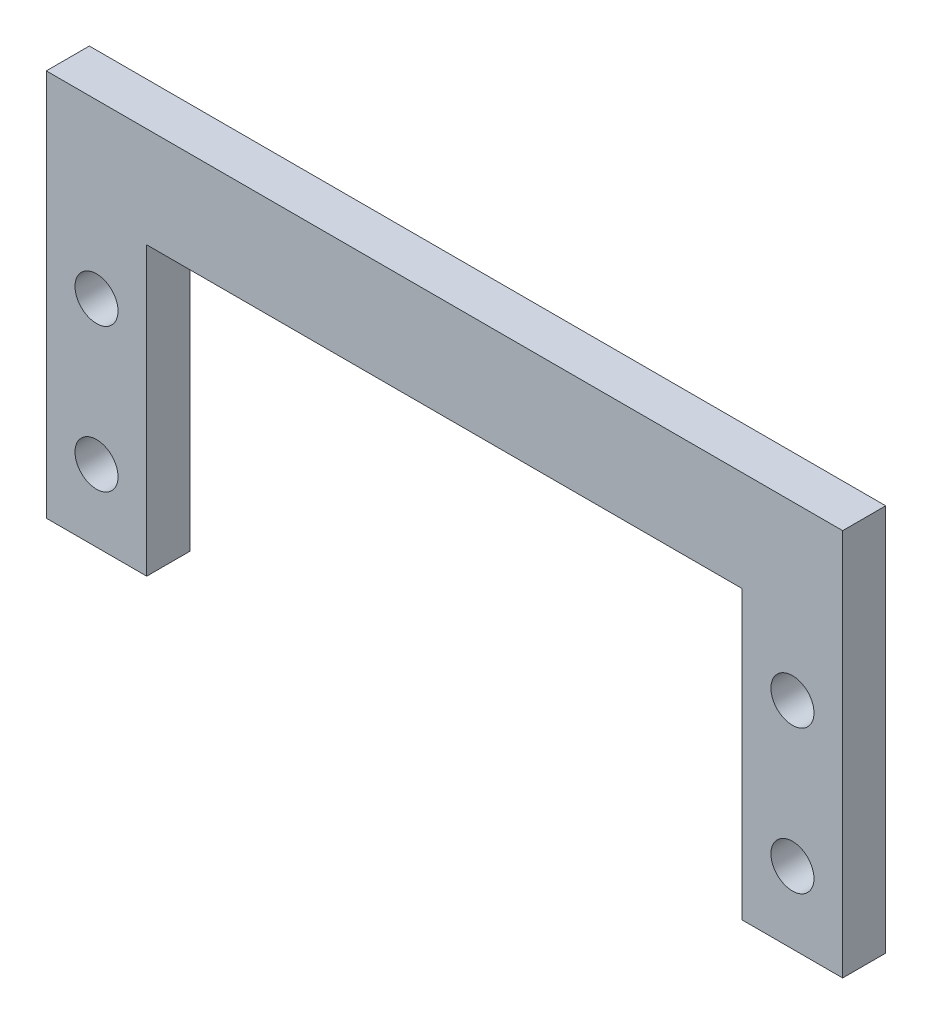
ISO-10303-21;
HEADER;
FILE_DESCRIPTION(('STEP AP214'),'2;1');
FILE_NAME('part.step','',(''),(''),'','','');
FILE_SCHEMA(('AUTOMOTIVE_DESIGN { 1 0 10303 214 1 1 1 1 }'));
ENDSEC;
DATA;
#1=APPLICATION_CONTEXT('core data for automotive mechanical design processes');
#2=APPLICATION_PROTOCOL_DEFINITION('international standard','automotive_design',2000,#1);
#3=PRODUCT_CONTEXT('',#1,'mechanical');
#4=PRODUCT('Part','Part','',(#3));
#5=PRODUCT_RELATED_PRODUCT_CATEGORY('part','',(#4));
#6=PRODUCT_DEFINITION_FORMATION('','',#4);
#7=PRODUCT_DEFINITION_CONTEXT('part definition',#1,'design');
#8=PRODUCT_DEFINITION('design','',#6,#7);
#9=PRODUCT_DEFINITION_SHAPE('','',#8);
#10=(LENGTH_UNIT() NAMED_UNIT(*) SI_UNIT(.MILLI.,.METRE.));
#11=(NAMED_UNIT(*) PLANE_ANGLE_UNIT() SI_UNIT($,.RADIAN.));
#12=(NAMED_UNIT(*) SI_UNIT($,.STERADIAN.) SOLID_ANGLE_UNIT());
#13=UNCERTAINTY_MEASURE_WITH_UNIT(LENGTH_MEASURE(1.E-05),#10,'distance_accuracy_value','');
#14=(GEOMETRIC_REPRESENTATION_CONTEXT(3) GLOBAL_UNCERTAINTY_ASSIGNED_CONTEXT((#13)) GLOBAL_UNIT_ASSIGNED_CONTEXT((#10,
#11,#12)) REPRESENTATION_CONTEXT('',''));
#15=CARTESIAN_POINT('',(0.,0.,0.));
#16=DIRECTION('',(0.,0.,1.));
#17=DIRECTION('',(1.,0.,0.));
#18=AXIS2_PLACEMENT_3D('',#15,#16,#17);
#19=CARTESIAN_POINT('',(0.,0.,1.5));
#20=DIRECTION('',(0.,0.,-1.));
#21=DIRECTION('',(-1.,0.,0.));
#22=AXIS2_PLACEMENT_3D('',#19,#20,#21);
#23=PLANE('',#22);
#24=CARTESIAN_POINT('',(14.25,5.,1.5));
#25=DIRECTION('',(0.,0.,1.));
#26=DIRECTION('',(1.,0.,0.));
#27=AXIS2_PLACEMENT_3D('',#24,#25,#26);
#28=CIRCLE('',#27,1.5);
#29=CARTESIAN_POINT('',(15.75,5.,1.5));
#30=VERTEX_POINT('',#29);
#31=EDGE_CURVE('E188',#30,#30,#28,.T.);
#32=ORIENTED_EDGE('',*,*,#31,.F.);
#33=EDGE_LOOP('',(#32));
#34=FACE_BOUND('',#33,.T.);
#35=CARTESIAN_POINT('',(-34.25,5.,1.5));
#36=DIRECTION('',(0.,0.,1.));
#37=DIRECTION('',(1.,0.,0.));
#38=AXIS2_PLACEMENT_3D('',#35,#36,#37);
#39=CIRCLE('',#38,1.5);
#40=CARTESIAN_POINT('',(-32.75,5.,1.5));
#41=VERTEX_POINT('',#40);
#42=EDGE_CURVE('E134',#41,#41,#39,.T.);
#43=ORIENTED_EDGE('',*,*,#42,.F.);
#44=EDGE_LOOP('',(#43));
#45=FACE_BOUND('',#44,.T.);
#46=DIRECTION('',(0.,1.,0.));
#47=VECTOR('',#46,1.);
#48=CARTESIAN_POINT('',(-30.75,10.,1.5));
#49=LINE('',#48,#47);
#50=CARTESIAN_POINT('',(-30.75,-10.,1.5));
#51=VERTEX_POINT('',#50);
#52=CARTESIAN_POINT('',(-30.75,10.,1.5));
#53=VERTEX_POINT('',#52);
#54=EDGE_CURVE('E145',#51,#53,#49,.T.);
#55=ORIENTED_EDGE('',*,*,#54,.T.);
#56=DIRECTION('',(1.,0.,0.));
#57=VECTOR('',#56,1.);
#58=CARTESIAN_POINT('',(-30.75,10.,1.5));
#59=LINE('',#58,#57);
#60=CARTESIAN_POINT('',(10.75,10.,1.5));
#61=VERTEX_POINT('',#60);
#62=EDGE_CURVE('E93',#53,#61,#59,.T.);
#63=ORIENTED_EDGE('',*,*,#62,.T.);
#64=DIRECTION('',(0.,-1.,0.));
#65=VECTOR('',#64,1.);
#66=CARTESIAN_POINT('',(10.75,10.,1.5));
#67=LINE('',#66,#65);
#68=CARTESIAN_POINT('',(10.75,-10.,1.5));
#69=VERTEX_POINT('',#68);
#70=EDGE_CURVE('E160',#61,#69,#67,.T.);
#71=ORIENTED_EDGE('',*,*,#70,.T.);
#72=DIRECTION('',(1.,0.,0.));
#73=VECTOR('',#72,1.);
#74=CARTESIAN_POINT('',(17.75,-10.,1.5));
#75=LINE('',#74,#73);
#76=CARTESIAN_POINT('',(17.75,-10.,1.5));
#77=VERTEX_POINT('',#76);
#78=EDGE_CURVE('E173',#69,#77,#75,.T.);
#79=ORIENTED_EDGE('',*,*,#78,.T.);
#80=DIRECTION('',(0.,1.,0.));
#81=VECTOR('',#80,1.);
#82=CARTESIAN_POINT('',(17.75,17.,1.5));
#83=LINE('',#82,#81);
#84=CARTESIAN_POINT('',(17.75,17.,1.5));
#85=VERTEX_POINT('',#84);
#86=EDGE_CURVE('E112',#77,#85,#83,.T.);
#87=ORIENTED_EDGE('',*,*,#86,.T.);
#88=DIRECTION('',(-1.,0.,0.));
#89=VECTOR('',#88,1.);
#90=CARTESIAN_POINT('',(-37.75,17.,1.5));
#91=LINE('',#90,#89);
#92=CARTESIAN_POINT('',(-37.75,17.,1.5));
#93=VERTEX_POINT('',#92);
#94=EDGE_CURVE('E106',#85,#93,#91,.T.);
#95=ORIENTED_EDGE('',*,*,#94,.T.);
#96=DIRECTION('',(0.,-1.,0.));
#97=VECTOR('',#96,1.);
#98=CARTESIAN_POINT('',(-37.75,-10.,1.5));
#99=LINE('',#98,#97);
#100=CARTESIAN_POINT('',(-37.75,-10.,1.5));
#101=VERTEX_POINT('',#100);
#102=EDGE_CURVE('E110',#93,#101,#99,.T.);
#103=ORIENTED_EDGE('',*,*,#102,.T.);
#104=DIRECTION('',(1.,0.,0.));
#105=VECTOR('',#104,1.);
#106=CARTESIAN_POINT('',(-30.75,-10.,1.5));
#107=LINE('',#106,#105);
#108=EDGE_CURVE('E50',#101,#51,#107,.T.);
#109=ORIENTED_EDGE('',*,*,#108,.T.);
#110=EDGE_LOOP('',(#55,#63,#71,#79,#87,#95,#103,#109));
#111=FACE_BOUND('',#110,.T.);
#112=CARTESIAN_POINT('',(-34.25,-5.,1.5));
#113=DIRECTION('',(0.,0.,1.));
#114=DIRECTION('',(1.,0.,0.));
#115=AXIS2_PLACEMENT_3D('',#112,#113,#114);
#116=CIRCLE('',#115,1.5);
#117=CARTESIAN_POINT('',(-32.75,-5.,1.5));
#118=VERTEX_POINT('',#117);
#119=EDGE_CURVE('E182',#118,#118,#116,.T.);
#120=ORIENTED_EDGE('',*,*,#119,.F.);
#121=EDGE_LOOP('',(#120));
#122=FACE_BOUND('',#121,.T.);
#123=CARTESIAN_POINT('',(14.25,-5.,1.5));
#124=DIRECTION('',(0.,0.,1.));
#125=DIRECTION('',(1.,0.,0.));
#126=AXIS2_PLACEMENT_3D('',#123,#124,#125);
#127=CIRCLE('',#126,1.5);
#128=CARTESIAN_POINT('',(15.75,-5.,1.5));
#129=VERTEX_POINT('',#128);
#130=EDGE_CURVE('E194',#129,#129,#127,.T.);
#131=ORIENTED_EDGE('',*,*,#130,.F.);
#132=EDGE_LOOP('',(#131));
#133=FACE_BOUND('',#132,.T.);
#134=ADVANCED_FACE('F33',(#34,#45,#111,#122,#133),#23,.F.);
#135=CARTESIAN_POINT('',(0.,0.,-1.5));
#136=DIRECTION('',(0.,0.,-1.));
#137=DIRECTION('',(-1.,0.,0.));
#138=AXIS2_PLACEMENT_3D('',#135,#136,#137);
#139=PLANE('',#138);
#140=CARTESIAN_POINT('',(14.25,5.,-1.5));
#141=DIRECTION('',(0.,0.,1.));
#142=DIRECTION('',(1.,0.,0.));
#143=AXIS2_PLACEMENT_3D('',#140,#141,#142);
#144=CIRCLE('',#143,1.5);
#145=CARTESIAN_POINT('',(15.75,5.,-1.5));
#146=VERTEX_POINT('',#145);
#147=EDGE_CURVE('E191',#146,#146,#144,.T.);
#148=ORIENTED_EDGE('',*,*,#147,.T.);
#149=EDGE_LOOP('',(#148));
#150=FACE_BOUND('',#149,.T.);
#151=CARTESIAN_POINT('',(-34.25,5.,-1.5));
#152=DIRECTION('',(0.,0.,1.));
#153=DIRECTION('',(1.,0.,0.));
#154=AXIS2_PLACEMENT_3D('',#151,#152,#153);
#155=CIRCLE('',#154,1.5);
#156=CARTESIAN_POINT('',(-32.75,5.,-1.5));
#157=VERTEX_POINT('',#156);
#158=EDGE_CURVE('E179',#157,#157,#155,.T.);
#159=ORIENTED_EDGE('',*,*,#158,.T.);
#160=EDGE_LOOP('',(#159));
#161=FACE_BOUND('',#160,.T.);
#162=DIRECTION('',(0.,1.,0.));
#163=VECTOR('',#162,1.);
#164=CARTESIAN_POINT('',(-30.75,10.,-1.5));
#165=LINE('',#164,#163);
#166=CARTESIAN_POINT('',(-30.75,-10.,-1.5));
#167=VERTEX_POINT('',#166);
#168=CARTESIAN_POINT('',(-30.75,10.,-1.5));
#169=VERTEX_POINT('',#168);
#170=EDGE_CURVE('E130',#167,#169,#165,.T.);
#171=ORIENTED_EDGE('',*,*,#170,.F.);
#172=DIRECTION('',(1.,0.,0.));
#173=VECTOR('',#172,1.);
#174=CARTESIAN_POINT('',(-30.75,-10.,-1.5));
#175=LINE('',#174,#173);
#176=CARTESIAN_POINT('',(-37.75,-10.,-1.5));
#177=VERTEX_POINT('',#176);
#178=EDGE_CURVE('E85',#177,#167,#175,.T.);
#179=ORIENTED_EDGE('',*,*,#178,.F.);
#180=DIRECTION('',(0.,-1.,0.));
#181=VECTOR('',#180,1.);
#182=CARTESIAN_POINT('',(-37.75,-10.,-1.5));
#183=LINE('',#182,#181);
#184=CARTESIAN_POINT('',(-37.75,17.,-1.5));
#185=VERTEX_POINT('',#184);
#186=EDGE_CURVE('E79',#185,#177,#183,.T.);
#187=ORIENTED_EDGE('',*,*,#186,.F.);
#188=DIRECTION('',(-1.,0.,0.));
#189=VECTOR('',#188,1.);
#190=CARTESIAN_POINT('',(-37.75,17.,-1.5));
#191=LINE('',#190,#189);
#192=CARTESIAN_POINT('',(17.75,17.,-1.5));
#193=VERTEX_POINT('',#192);
#194=EDGE_CURVE('E120',#193,#185,#191,.T.);
#195=ORIENTED_EDGE('',*,*,#194,.F.);
#196=DIRECTION('',(0.,1.,0.));
#197=VECTOR('',#196,1.);
#198=CARTESIAN_POINT('',(17.75,17.,-1.5));
#199=LINE('',#198,#197);
#200=CARTESIAN_POINT('',(17.75,-10.,-1.5));
#201=VERTEX_POINT('',#200);
#202=EDGE_CURVE('E140',#201,#193,#199,.T.);
#203=ORIENTED_EDGE('',*,*,#202,.F.);
#204=DIRECTION('',(1.,0.,0.));
#205=VECTOR('',#204,1.);
#206=CARTESIAN_POINT('',(17.75,-10.,-1.5));
#207=LINE('',#206,#205);
#208=CARTESIAN_POINT('',(10.75,-10.,-1.5));
#209=VERTEX_POINT('',#208);
#210=EDGE_CURVE('E138',#209,#201,#207,.T.);
#211=ORIENTED_EDGE('',*,*,#210,.F.);
#212=DIRECTION('',(0.,-1.,0.));
#213=VECTOR('',#212,1.);
#214=CARTESIAN_POINT('',(10.75,10.,-1.5));
#215=LINE('',#214,#213);
#216=CARTESIAN_POINT('',(10.75,10.,-1.5));
#217=VERTEX_POINT('',#216);
#218=EDGE_CURVE('E136',#217,#209,#215,.T.);
#219=ORIENTED_EDGE('',*,*,#218,.F.);
#220=DIRECTION('',(1.,0.,0.));
#221=VECTOR('',#220,1.);
#222=CARTESIAN_POINT('',(-30.75,10.,-1.5));
#223=LINE('',#222,#221);
#224=EDGE_CURVE('E133',#169,#217,#223,.T.);
#225=ORIENTED_EDGE('',*,*,#224,.F.);
#226=EDGE_LOOP('',(#171,#179,#187,#195,#203,#211,#219,#225));
#227=FACE_BOUND('',#226,.T.);
#228=CARTESIAN_POINT('',(-34.25,-5.,-1.5));
#229=DIRECTION('',(0.,0.,1.));
#230=DIRECTION('',(1.,0.,0.));
#231=AXIS2_PLACEMENT_3D('',#228,#229,#230);
#232=CIRCLE('',#231,1.5);
#233=CARTESIAN_POINT('',(-32.75,-5.,-1.5));
#234=VERTEX_POINT('',#233);
#235=EDGE_CURVE('E185',#234,#234,#232,.T.);
#236=ORIENTED_EDGE('',*,*,#235,.T.);
#237=EDGE_LOOP('',(#236));
#238=FACE_BOUND('',#237,.T.);
#239=CARTESIAN_POINT('',(14.25,-5.,-1.5));
#240=DIRECTION('',(0.,0.,1.));
#241=DIRECTION('',(1.,0.,0.));
#242=AXIS2_PLACEMENT_3D('',#239,#240,#241);
#243=CIRCLE('',#242,1.5);
#244=CARTESIAN_POINT('',(15.75,-5.,-1.5));
#245=VERTEX_POINT('',#244);
#246=EDGE_CURVE('E197',#245,#245,#243,.T.);
#247=ORIENTED_EDGE('',*,*,#246,.T.);
#248=EDGE_LOOP('',(#247));
#249=FACE_BOUND('',#248,.T.);
#250=ADVANCED_FACE('F164',(#150,#161,#227,#238,#249),#139,.T.);
#251=CARTESIAN_POINT('',(-30.75,10.,1.5));
#252=DIRECTION('',(-1.,0.,0.));
#253=DIRECTION('',(0.,0.,1.));
#254=AXIS2_PLACEMENT_3D('',#251,#252,#253);
#255=PLANE('',#254);
#256=ORIENTED_EDGE('',*,*,#170,.T.);
#257=DIRECTION('',(0.,0.,-1.));
#258=VECTOR('',#257,1.);
#259=CARTESIAN_POINT('',(-30.75,10.,1.5));
#260=LINE('',#259,#258);
#261=EDGE_CURVE('E11',#53,#169,#260,.T.);
#262=ORIENTED_EDGE('',*,*,#261,.F.);
#263=ORIENTED_EDGE('',*,*,#54,.F.);
#264=DIRECTION('',(0.,0.,-1.));
#265=VECTOR('',#264,1.);
#266=CARTESIAN_POINT('',(-30.75,-10.,1.5));
#267=LINE('',#266,#265);
#268=EDGE_CURVE('E126',#51,#167,#267,.T.);
#269=ORIENTED_EDGE('',*,*,#268,.T.);
#270=EDGE_LOOP('',(#256,#262,#263,#269));
#271=FACE_BOUND('',#270,.T.);
#272=ADVANCED_FACE('F35',(#271),#255,.F.);
#273=CARTESIAN_POINT('',(-30.75,10.,1.5));
#274=DIRECTION('',(0.,1.,0.));
#275=DIRECTION('',(-1.,0.,0.));
#276=AXIS2_PLACEMENT_3D('',#273,#274,#275);
#277=PLANE('',#276);
#278=ORIENTED_EDGE('',*,*,#224,.T.);
#279=DIRECTION('',(0.,0.,-1.));
#280=VECTOR('',#279,1.);
#281=CARTESIAN_POINT('',(10.75,10.,1.5));
#282=LINE('',#281,#280);
#283=EDGE_CURVE('E42',#61,#217,#282,.T.);
#284=ORIENTED_EDGE('',*,*,#283,.F.);
#285=ORIENTED_EDGE('',*,*,#62,.F.);
#286=ORIENTED_EDGE('',*,*,#261,.T.);
#287=EDGE_LOOP('',(#278,#284,#285,#286));
#288=FACE_BOUND('',#287,.T.);
#289=ADVANCED_FACE('F232',(#288),#277,.F.);
#290=CARTESIAN_POINT('',(10.75,10.,1.5));
#291=DIRECTION('',(1.,0.,0.));
#292=DIRECTION('',(0.,1.,0.));
#293=AXIS2_PLACEMENT_3D('',#290,#291,#292);
#294=PLANE('',#293);
#295=ORIENTED_EDGE('',*,*,#218,.T.);
#296=DIRECTION('',(0.,0.,-1.));
#297=VECTOR('',#296,1.);
#298=CARTESIAN_POINT('',(10.75,-10.,1.5));
#299=LINE('',#298,#297);
#300=EDGE_CURVE('E152',#69,#209,#299,.T.);
#301=ORIENTED_EDGE('',*,*,#300,.F.);
#302=ORIENTED_EDGE('',*,*,#70,.F.);
#303=ORIENTED_EDGE('',*,*,#283,.T.);
#304=EDGE_LOOP('',(#295,#301,#302,#303));
#305=FACE_BOUND('',#304,.T.);
#306=ADVANCED_FACE('F158',(#305),#294,.F.);
#307=CARTESIAN_POINT('',(17.75,-10.,1.5));
#308=DIRECTION('',(0.,1.,0.));
#309=DIRECTION('',(0.,0.,1.));
#310=AXIS2_PLACEMENT_3D('',#307,#308,#309);
#311=PLANE('',#310);
#312=ORIENTED_EDGE('',*,*,#210,.T.);
#313=DIRECTION('',(0.,0.,-1.));
#314=VECTOR('',#313,1.);
#315=CARTESIAN_POINT('',(17.75,-10.,1.5));
#316=LINE('',#315,#314);
#317=EDGE_CURVE('E149',#77,#201,#316,.T.);
#318=ORIENTED_EDGE('',*,*,#317,.F.);
#319=ORIENTED_EDGE('',*,*,#78,.F.);
#320=ORIENTED_EDGE('',*,*,#300,.T.);
#321=EDGE_LOOP('',(#312,#318,#319,#320));
#322=FACE_BOUND('',#321,.T.);
#323=ADVANCED_FACE('F169',(#322),#311,.F.);
#324=CARTESIAN_POINT('',(17.75,17.,1.5));
#325=DIRECTION('',(-1.,0.,0.));
#326=DIRECTION('',(0.,-1.,0.));
#327=AXIS2_PLACEMENT_3D('',#324,#325,#326);
#328=PLANE('',#327);
#329=ORIENTED_EDGE('',*,*,#202,.T.);
#330=DIRECTION('',(0.,0.,-1.));
#331=VECTOR('',#330,1.);
#332=CARTESIAN_POINT('',(17.75,17.,1.5));
#333=LINE('',#332,#331);
#334=EDGE_CURVE('E121',#85,#193,#333,.T.);
#335=ORIENTED_EDGE('',*,*,#334,.F.);
#336=ORIENTED_EDGE('',*,*,#86,.F.);
#337=ORIENTED_EDGE('',*,*,#317,.T.);
#338=EDGE_LOOP('',(#329,#335,#336,#337));
#339=FACE_BOUND('',#338,.T.);
#340=ADVANCED_FACE('F172',(#339),#328,.F.);
#341=CARTESIAN_POINT('',(-37.75,17.,1.5));
#342=DIRECTION('',(0.,-1.,0.));
#343=DIRECTION('',(0.,0.,-1.));
#344=AXIS2_PLACEMENT_3D('',#341,#342,#343);
#345=PLANE('',#344);
#346=ORIENTED_EDGE('',*,*,#194,.T.);
#347=DIRECTION('',(0.,0.,-1.));
#348=VECTOR('',#347,1.);
#349=CARTESIAN_POINT('',(-37.75,17.,1.5));
#350=LINE('',#349,#348);
#351=EDGE_CURVE('E117',#93,#185,#350,.T.);
#352=ORIENTED_EDGE('',*,*,#351,.F.);
#353=ORIENTED_EDGE('',*,*,#94,.F.);
#354=ORIENTED_EDGE('',*,*,#334,.T.);
#355=EDGE_LOOP('',(#346,#352,#353,#354));
#356=FACE_BOUND('',#355,.T.);
#357=ADVANCED_FACE('F118',(#356),#345,.F.);
#358=CARTESIAN_POINT('',(-37.75,-10.,1.5));
#359=DIRECTION('',(1.,0.,0.));
#360=DIRECTION('',(0.,0.,-1.));
#361=AXIS2_PLACEMENT_3D('',#358,#359,#360);
#362=PLANE('',#361);
#363=ORIENTED_EDGE('',*,*,#186,.T.);
#364=DIRECTION('',(0.,0.,-1.));
#365=VECTOR('',#364,1.);
#366=CARTESIAN_POINT('',(-37.75,-10.,1.5));
#367=LINE('',#366,#365);
#368=EDGE_CURVE('E122',#101,#177,#367,.T.);
#369=ORIENTED_EDGE('',*,*,#368,.F.);
#370=ORIENTED_EDGE('',*,*,#102,.F.);
#371=ORIENTED_EDGE('',*,*,#351,.T.);
#372=EDGE_LOOP('',(#363,#369,#370,#371));
#373=FACE_BOUND('',#372,.T.);
#374=ADVANCED_FACE('F124',(#373),#362,.F.);
#375=CARTESIAN_POINT('',(-30.75,-10.,1.5));
#376=DIRECTION('',(0.,1.,0.));
#377=DIRECTION('',(0.,0.,1.));
#378=AXIS2_PLACEMENT_3D('',#375,#376,#377);
#379=PLANE('',#378);
#380=ORIENTED_EDGE('',*,*,#178,.T.);
#381=ORIENTED_EDGE('',*,*,#268,.F.);
#382=ORIENTED_EDGE('',*,*,#108,.F.);
#383=ORIENTED_EDGE('',*,*,#368,.T.);
#384=EDGE_LOOP('',(#380,#381,#382,#383));
#385=FACE_BOUND('',#384,.T.);
#386=ADVANCED_FACE('F220',(#385),#379,.F.);
#387=CARTESIAN_POINT('',(-34.25,5.,1.5));
#388=DIRECTION('',(0.,0.,-1.));
#389=DIRECTION('',(-1.,0.,0.));
#390=AXIS2_PLACEMENT_3D('',#387,#388,#389);
#391=CYLINDRICAL_SURFACE('',#390,1.5);
#392=ORIENTED_EDGE('',*,*,#42,.T.);
#393=EDGE_LOOP('',(#392));
#394=FACE_BOUND('',#393,.T.);
#395=ORIENTED_EDGE('',*,*,#158,.F.);
#396=EDGE_LOOP('',(#395));
#397=FACE_BOUND('',#396,.T.);
#398=ADVANCED_FACE('F217',(#394,#397),#391,.F.);
#399=CARTESIAN_POINT('',(-34.25,-5.,1.5));
#400=DIRECTION('',(0.,0.,-1.));
#401=DIRECTION('',(-1.,0.,0.));
#402=AXIS2_PLACEMENT_3D('',#399,#400,#401);
#403=CYLINDRICAL_SURFACE('',#402,1.5);
#404=ORIENTED_EDGE('',*,*,#119,.T.);
#405=EDGE_LOOP('',(#404));
#406=FACE_BOUND('',#405,.T.);
#407=ORIENTED_EDGE('',*,*,#235,.F.);
#408=EDGE_LOOP('',(#407));
#409=FACE_BOUND('',#408,.T.);
#410=ADVANCED_FACE('F296',(#406,#409),#403,.F.);
#411=CARTESIAN_POINT('',(14.25,5.,1.5));
#412=DIRECTION('',(0.,0.,-1.));
#413=DIRECTION('',(-1.,0.,0.));
#414=AXIS2_PLACEMENT_3D('',#411,#412,#413);
#415=CYLINDRICAL_SURFACE('',#414,1.5);
#416=ORIENTED_EDGE('',*,*,#31,.T.);
#417=EDGE_LOOP('',(#416));
#418=FACE_BOUND('',#417,.T.);
#419=ORIENTED_EDGE('',*,*,#147,.F.);
#420=EDGE_LOOP('',(#419));
#421=FACE_BOUND('',#420,.T.);
#422=ADVANCED_FACE('F304',(#418,#421),#415,.F.);
#423=CARTESIAN_POINT('',(14.25,-5.,1.5));
#424=DIRECTION('',(0.,0.,-1.));
#425=DIRECTION('',(-1.,0.,0.));
#426=AXIS2_PLACEMENT_3D('',#423,#424,#425);
#427=CYLINDRICAL_SURFACE('',#426,1.5);
#428=ORIENTED_EDGE('',*,*,#130,.T.);
#429=EDGE_LOOP('',(#428));
#430=FACE_BOUND('',#429,.T.);
#431=ORIENTED_EDGE('',*,*,#246,.F.);
#432=EDGE_LOOP('',(#431));
#433=FACE_BOUND('',#432,.T.);
#434=ADVANCED_FACE('F203',(#430,#433),#427,.F.);
#435=CLOSED_SHELL('',(#134,#250,#272,#289,#306,#323,#340,#357,#374,#386,#398,#410,#422,#434));
#436=MANIFOLD_SOLID_BREP('B2',#435);
#437=ADVANCED_BREP_SHAPE_REPRESENTATION('',(#18,#436),#14);
#438=SHAPE_DEFINITION_REPRESENTATION(#9,#437);
ENDSEC;
END-ISO-10303-21;
